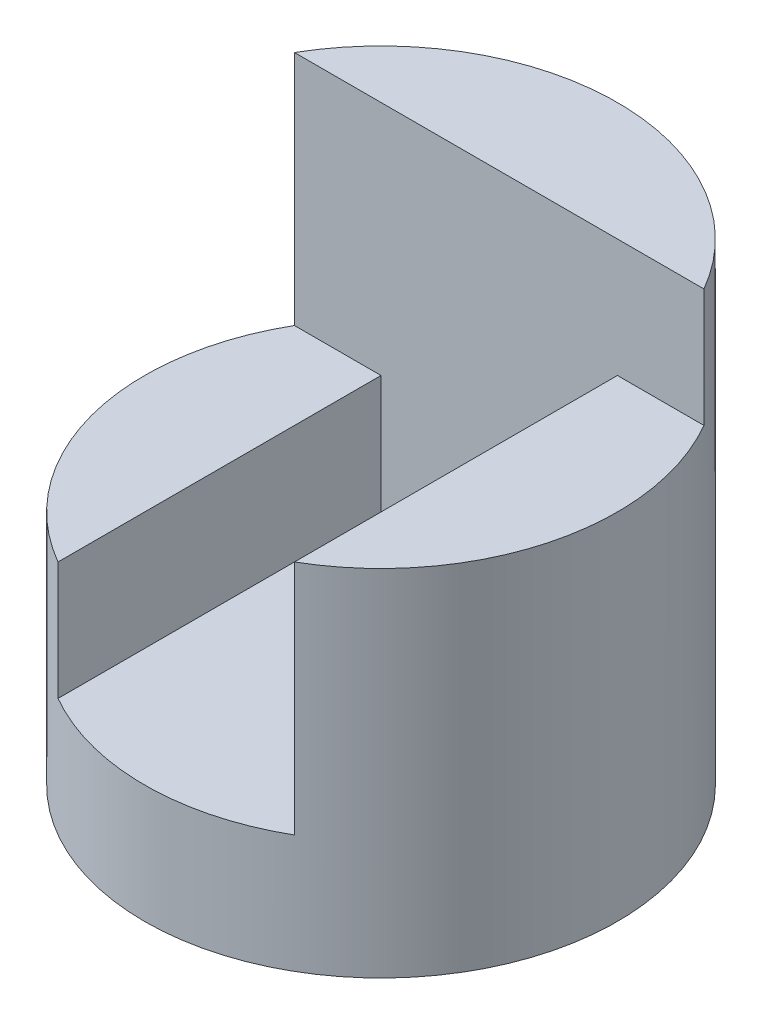
ISO-10303-21;
HEADER;
FILE_DESCRIPTION(('STEP AP214'),'2;1');
FILE_NAME('part.step','',(''),(''),'','','');
FILE_SCHEMA(('AUTOMOTIVE_DESIGN { 1 0 10303 214 1 1 1 1 }'));
ENDSEC;
DATA;
#1=APPLICATION_CONTEXT('core data for automotive mechanical design processes');
#2=APPLICATION_PROTOCOL_DEFINITION('international standard','automotive_design',2000,#1);
#3=PRODUCT_CONTEXT('',#1,'mechanical');
#4=PRODUCT('Part','Part','',(#3));
#5=PRODUCT_RELATED_PRODUCT_CATEGORY('part','',(#4));
#6=PRODUCT_DEFINITION_FORMATION('','',#4);
#7=PRODUCT_DEFINITION_CONTEXT('part definition',#1,'design');
#8=PRODUCT_DEFINITION('design','',#6,#7);
#9=PRODUCT_DEFINITION_SHAPE('','',#8);
#10=(LENGTH_UNIT() NAMED_UNIT(*) SI_UNIT(.MILLI.,.METRE.));
#11=(NAMED_UNIT(*) PLANE_ANGLE_UNIT() SI_UNIT($,.RADIAN.));
#12=(NAMED_UNIT(*) SI_UNIT($,.STERADIAN.) SOLID_ANGLE_UNIT());
#13=UNCERTAINTY_MEASURE_WITH_UNIT(LENGTH_MEASURE(1.E-05),#10,'distance_accuracy_value','');
#14=(GEOMETRIC_REPRESENTATION_CONTEXT(3) GLOBAL_UNCERTAINTY_ASSIGNED_CONTEXT((#13)) GLOBAL_UNIT_ASSIGNED_CONTEXT((#10,
#11,#12)) REPRESENTATION_CONTEXT('',''));
#15=CARTESIAN_POINT('',(0.,0.,0.));
#16=DIRECTION('',(0.,0.,1.));
#17=DIRECTION('',(1.,0.,0.));
#18=AXIS2_PLACEMENT_3D('',#15,#16,#17);
#19=CARTESIAN_POINT('',(0.,4.,0.));
#20=DIRECTION('',(0.,-1.,0.));
#21=DIRECTION('',(0.,0.,-1.));
#22=AXIS2_PLACEMENT_3D('',#19,#20,#21);
#23=CYLINDRICAL_SURFACE('',#22,2.);
#24=CARTESIAN_POINT('',(0.,0.,0.));
#25=DIRECTION('',(0.,1.,0.));
#26=DIRECTION('',(0.,0.,1.));
#27=AXIS2_PLACEMENT_3D('',#24,#25,#26);
#28=CIRCLE('',#27,2.);
#29=CARTESIAN_POINT('',(0.,0.,2.));
#30=VERTEX_POINT('',#29);
#31=EDGE_CURVE('E120',#30,#30,#28,.T.);
#32=ORIENTED_EDGE('',*,*,#31,.T.);
#33=EDGE_LOOP('',(#32));
#34=FACE_BOUND('',#33,.T.);
#35=DIRECTION('',(0.,-1.,0.));
#36=VECTOR('',#35,1.);
#37=CARTESIAN_POINT('',(-1.,4.,1.73205080756888));
#38=LINE('',#37,#36);
#39=CARTESIAN_POINT('',(-1.,2.,1.73205080756888));
#40=VERTEX_POINT('',#39);
#41=CARTESIAN_POINT('',(-1.,1.,1.73205080756888));
#42=VERTEX_POINT('',#41);
#43=EDGE_CURVE('E55',#40,#42,#38,.T.);
#44=ORIENTED_EDGE('',*,*,#43,.F.);
#45=CARTESIAN_POINT('',(0.,2.,0.));
#46=DIRECTION('',(0.,1.,0.));
#47=DIRECTION('',(0.,0.,1.));
#48=AXIS2_PLACEMENT_3D('',#45,#46,#47);
#49=CIRCLE('',#48,2.);
#50=CARTESIAN_POINT('',(-1.73205080756888,2.,-1.));
#51=VERTEX_POINT('',#50);
#52=EDGE_CURVE('E91',#51,#40,#49,.T.);
#53=ORIENTED_EDGE('',*,*,#52,.F.);
#54=DIRECTION('',(0.,-1.,0.));
#55=VECTOR('',#54,1.);
#56=CARTESIAN_POINT('',(-1.73205080756888,4.,-1.));
#57=LINE('',#56,#55);
#58=CARTESIAN_POINT('',(-1.73205080756888,4.,-1.));
#59=VERTEX_POINT('',#58);
#60=EDGE_CURVE('E98',#51,#59,#57,.F.);
#61=ORIENTED_EDGE('',*,*,#60,.T.);
#62=CARTESIAN_POINT('',(0.,4.,0.));
#63=DIRECTION('',(0.,1.,0.));
#64=DIRECTION('',(0.,0.,1.));
#65=AXIS2_PLACEMENT_3D('',#62,#63,#64);
#66=CIRCLE('',#65,2.);
#67=CARTESIAN_POINT('',(1.73205080756888,4.,-1.));
#68=VERTEX_POINT('',#67);
#69=EDGE_CURVE('E121',#68,#59,#66,.T.);
#70=ORIENTED_EDGE('',*,*,#69,.F.);
#71=DIRECTION('',(0.,-1.,0.));
#72=VECTOR('',#71,1.);
#73=CARTESIAN_POINT('',(1.73205080756888,4.,-1.));
#74=LINE('',#73,#72);
#75=CARTESIAN_POINT('',(1.73205080756888,3.,-1.));
#76=VERTEX_POINT('',#75);
#77=EDGE_CURVE('E47',#68,#76,#74,.T.);
#78=ORIENTED_EDGE('',*,*,#77,.T.);
#79=CARTESIAN_POINT('',(0.,3.,0.));
#80=DIRECTION('',(0.,1.,0.));
#81=DIRECTION('',(0.,0.,1.));
#82=AXIS2_PLACEMENT_3D('',#79,#80,#81);
#83=CIRCLE('',#82,2.);
#84=CARTESIAN_POINT('',(1.,3.,1.73205080756888));
#85=VERTEX_POINT('',#84);
#86=EDGE_CURVE('E11',#85,#76,#83,.T.);
#87=ORIENTED_EDGE('',*,*,#86,.F.);
#88=DIRECTION('',(0.,-1.,0.));
#89=VECTOR('',#88,1.);
#90=CARTESIAN_POINT('',(1.,4.,1.73205080756888));
#91=LINE('',#90,#89);
#92=CARTESIAN_POINT('',(1.,1.,1.73205080756888));
#93=VERTEX_POINT('',#92);
#94=EDGE_CURVE('E40',#93,#85,#91,.F.);
#95=ORIENTED_EDGE('',*,*,#94,.F.);
#96=CARTESIAN_POINT('',(0.,1.,0.));
#97=DIRECTION('',(0.,1.,0.));
#98=DIRECTION('',(-1.,0.,0.));
#99=AXIS2_PLACEMENT_3D('',#96,#97,#98);
#100=CIRCLE('',#99,2.);
#101=EDGE_CURVE('E129',#42,#93,#100,.T.);
#102=ORIENTED_EDGE('',*,*,#101,.F.);
#103=EDGE_LOOP('',(#44,#53,#61,#70,#78,#87,#95,#102));
#104=FACE_BOUND('',#103,.T.);
#105=ADVANCED_FACE('F33',(#34,#104),#23,.T.);
#106=CARTESIAN_POINT('',(-1.,1.,3.));
#107=DIRECTION('',(1.,0.,0.));
#108=DIRECTION('',(0.,0.,-1.));
#109=AXIS2_PLACEMENT_3D('',#106,#107,#108);
#110=PLANE('',#109);
#111=DIRECTION('',(0.,-1.,0.));
#112=VECTOR('',#111,1.);
#113=CARTESIAN_POINT('',(-1.,1.,-1.));
#114=LINE('',#113,#112);
#115=CARTESIAN_POINT('',(-1.,2.,-1.));
#116=VERTEX_POINT('',#115);
#117=CARTESIAN_POINT('',(-1.,1.,-1.));
#118=VERTEX_POINT('',#117);
#119=EDGE_CURVE('E96',#116,#118,#114,.T.);
#120=ORIENTED_EDGE('',*,*,#119,.F.);
#121=DIRECTION('',(0.,0.,-1.));
#122=VECTOR('',#121,1.);
#123=CARTESIAN_POINT('',(-1.,2.,11.));
#124=LINE('',#123,#122);
#125=EDGE_CURVE('E86',#40,#116,#124,.T.);
#126=ORIENTED_EDGE('',*,*,#125,.F.);
#127=ORIENTED_EDGE('',*,*,#43,.T.);
#128=DIRECTION('',(0.,0.,-1.));
#129=VECTOR('',#128,1.);
#130=CARTESIAN_POINT('',(-1.,1.,3.));
#131=LINE('',#130,#129);
#132=EDGE_CURVE('E101',#42,#118,#131,.T.);
#133=ORIENTED_EDGE('',*,*,#132,.T.);
#134=EDGE_LOOP('',(#120,#126,#127,#133));
#135=FACE_BOUND('',#134,.T.);
#136=ADVANCED_FACE('F100',(#135),#110,.T.);
#137=CARTESIAN_POINT('',(0.,4.,0.));
#138=DIRECTION('',(0.,1.,0.));
#139=DIRECTION('',(0.,0.,1.));
#140=AXIS2_PLACEMENT_3D('',#137,#138,#139);
#141=PLANE('',#140);
#142=DIRECTION('',(-1.,0.,0.));
#143=VECTOR('',#142,1.);
#144=CARTESIAN_POINT('',(0.,4.,-1.));
#145=LINE('',#144,#143);
#146=EDGE_CURVE('E124',#68,#59,#145,.T.);
#147=ORIENTED_EDGE('',*,*,#146,.F.);
#148=ORIENTED_EDGE('',*,*,#69,.T.);
#149=EDGE_LOOP('',(#147,#148));
#150=FACE_BOUND('',#149,.T.);
#151=ADVANCED_FACE('F144',(#150),#141,.T.);
#152=CARTESIAN_POINT('',(0.,0.,0.));
#153=DIRECTION('',(0.,1.,0.));
#154=DIRECTION('',(0.,0.,1.));
#155=AXIS2_PLACEMENT_3D('',#152,#153,#154);
#156=PLANE('',#155);
#157=ORIENTED_EDGE('',*,*,#31,.F.);
#158=EDGE_LOOP('',(#157));
#159=FACE_BOUND('',#158,.T.);
#160=ADVANCED_FACE('F146',(#159),#156,.F.);
#161=CARTESIAN_POINT('',(1.,1.,3.));
#162=DIRECTION('',(0.,1.,0.));
#163=DIRECTION('',(-1.,0.,0.));
#164=AXIS2_PLACEMENT_3D('',#161,#162,#163);
#165=PLANE('',#164);
#166=ORIENTED_EDGE('',*,*,#101,.T.);
#167=DIRECTION('',(0.,0.,-1.));
#168=VECTOR('',#167,1.);
#169=CARTESIAN_POINT('',(1.,1.,3.));
#170=LINE('',#169,#168);
#171=CARTESIAN_POINT('',(1.,1.,-1.));
#172=VERTEX_POINT('',#171);
#173=EDGE_CURVE('E115',#93,#172,#170,.T.);
#174=ORIENTED_EDGE('',*,*,#173,.T.);
#175=DIRECTION('',(1.,0.,0.));
#176=VECTOR('',#175,1.);
#177=CARTESIAN_POINT('',(1.,1.,-1.));
#178=LINE('',#177,#176);
#179=EDGE_CURVE('E103',#118,#172,#178,.T.);
#180=ORIENTED_EDGE('',*,*,#179,.F.);
#181=ORIENTED_EDGE('',*,*,#132,.F.);
#182=EDGE_LOOP('',(#166,#174,#180,#181));
#183=FACE_BOUND('',#182,.T.);
#184=ADVANCED_FACE('F151',(#183),#165,.T.);
#185=CARTESIAN_POINT('',(1.,3.,3.));
#186=DIRECTION('',(-1.,0.,0.));
#187=DIRECTION('',(0.,-1.,0.));
#188=AXIS2_PLACEMENT_3D('',#185,#186,#187);
#189=PLANE('',#188);
#190=ORIENTED_EDGE('',*,*,#94,.T.);
#191=DIRECTION('',(0.,0.,-1.));
#192=VECTOR('',#191,1.);
#193=CARTESIAN_POINT('',(1.,3.,3.));
#194=LINE('',#193,#192);
#195=CARTESIAN_POINT('',(1.,3.,-1.));
#196=VERTEX_POINT('',#195);
#197=EDGE_CURVE('E113',#85,#196,#194,.T.);
#198=ORIENTED_EDGE('',*,*,#197,.T.);
#199=DIRECTION('',(0.,1.,0.));
#200=VECTOR('',#199,1.);
#201=CARTESIAN_POINT('',(1.,3.,-1.));
#202=LINE('',#201,#200);
#203=EDGE_CURVE('E105',#172,#196,#202,.T.);
#204=ORIENTED_EDGE('',*,*,#203,.F.);
#205=ORIENTED_EDGE('',*,*,#173,.F.);
#206=EDGE_LOOP('',(#190,#198,#204,#205));
#207=FACE_BOUND('',#206,.T.);
#208=ADVANCED_FACE('F134',(#207),#189,.T.);
#209=CARTESIAN_POINT('',(2.,3.,3.));
#210=DIRECTION('',(0.,1.,0.));
#211=DIRECTION('',(0.,0.,1.));
#212=AXIS2_PLACEMENT_3D('',#209,#210,#211);
#213=PLANE('',#212);
#214=ORIENTED_EDGE('',*,*,#86,.T.);
#215=DIRECTION('',(1.,0.,0.));
#216=VECTOR('',#215,1.);
#217=CARTESIAN_POINT('',(2.,3.,-1.));
#218=LINE('',#217,#216);
#219=EDGE_CURVE('E111',#196,#76,#218,.T.);
#220=ORIENTED_EDGE('',*,*,#219,.F.);
#221=ORIENTED_EDGE('',*,*,#197,.F.);
#222=EDGE_LOOP('',(#214,#220,#221));
#223=FACE_BOUND('',#222,.T.);
#224=ADVANCED_FACE('F141',(#223),#213,.T.);
#225=CARTESIAN_POINT('',(0.,0.,-1.));
#226=DIRECTION('',(0.,0.,-1.));
#227=DIRECTION('',(-1.,0.,0.));
#228=AXIS2_PLACEMENT_3D('',#225,#226,#227);
#229=PLANE('',#228);
#230=DIRECTION('',(1.,0.,0.));
#231=VECTOR('',#230,1.);
#232=CARTESIAN_POINT('',(-1.,2.,-1.));
#233=LINE('',#232,#231);
#234=EDGE_CURVE('E89',#51,#116,#233,.T.);
#235=ORIENTED_EDGE('',*,*,#234,.T.);
#236=ORIENTED_EDGE('',*,*,#119,.T.);
#237=ORIENTED_EDGE('',*,*,#179,.T.);
#238=ORIENTED_EDGE('',*,*,#203,.T.);
#239=ORIENTED_EDGE('',*,*,#219,.T.);
#240=ORIENTED_EDGE('',*,*,#77,.F.);
#241=ORIENTED_EDGE('',*,*,#146,.T.);
#242=ORIENTED_EDGE('',*,*,#60,.F.);
#243=EDGE_LOOP('',(#235,#236,#237,#238,#239,#240,#241,#242));
#244=FACE_BOUND('',#243,.T.);
#245=ADVANCED_FACE('F94',(#244),#229,.F.);
#246=CARTESIAN_POINT('',(-1.,2.,11.));
#247=DIRECTION('',(0.,1.,0.));
#248=DIRECTION('',(0.,0.,1.));
#249=AXIS2_PLACEMENT_3D('',#246,#247,#248);
#250=PLANE('',#249);
#251=ORIENTED_EDGE('',*,*,#52,.T.);
#252=ORIENTED_EDGE('',*,*,#125,.T.);
#253=ORIENTED_EDGE('',*,*,#234,.F.);
#254=EDGE_LOOP('',(#251,#252,#253));
#255=FACE_BOUND('',#254,.T.);
#256=ADVANCED_FACE('F88',(#255),#250,.T.);
#257=CLOSED_SHELL('',(#105,#136,#151,#160,#184,#208,#224,#245,#256));
#258=MANIFOLD_SOLID_BREP('B2',#257);
#259=ADVANCED_BREP_SHAPE_REPRESENTATION('',(#18,#258),#14);
#260=SHAPE_DEFINITION_REPRESENTATION(#9,#259);
ENDSEC;
END-ISO-10303-21;
